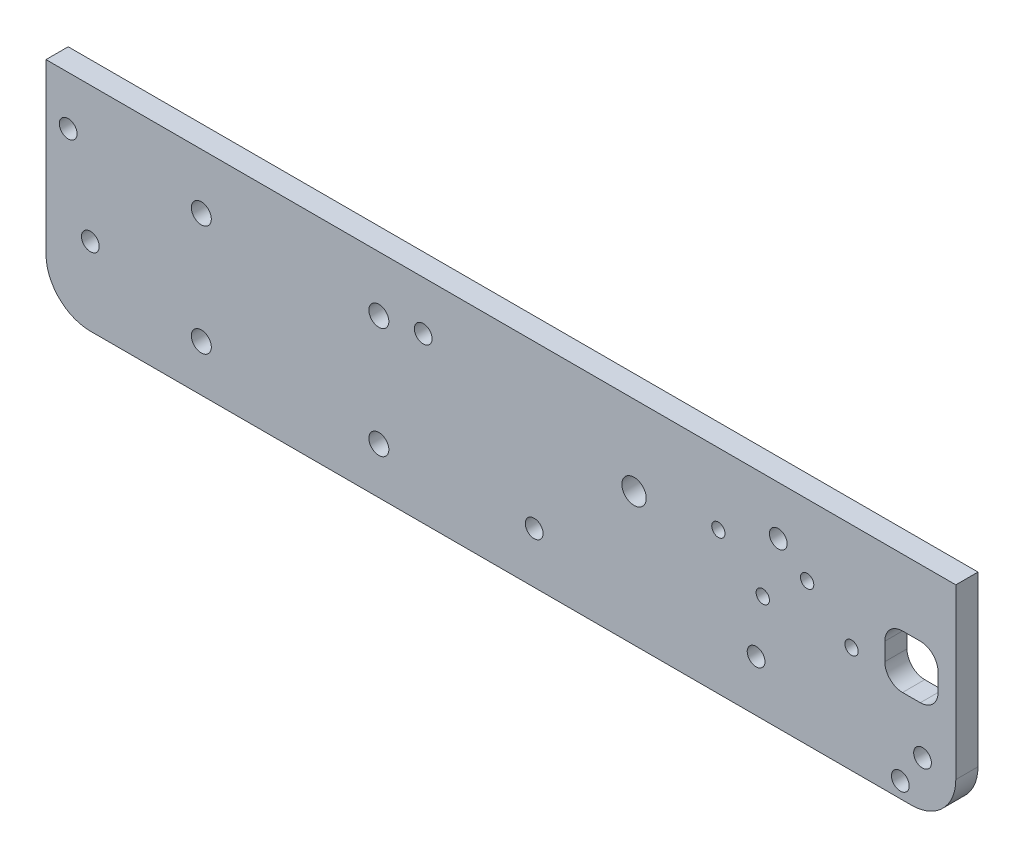
ISO-10303-21;
HEADER;
FILE_DESCRIPTION(('STEP AP214'),'2;1');
FILE_NAME('part.step','',(''),(''),'','','');
FILE_SCHEMA(('AUTOMOTIVE_DESIGN { 1 0 10303 214 1 1 1 1 }'));
ENDSEC;
DATA;
#1=APPLICATION_CONTEXT('core data for automotive mechanical design processes');
#2=APPLICATION_PROTOCOL_DEFINITION('international standard','automotive_design',2000,#1);
#3=PRODUCT_CONTEXT('',#1,'mechanical');
#4=PRODUCT('Part','Part','',(#3));
#5=PRODUCT_RELATED_PRODUCT_CATEGORY('part','',(#4));
#6=PRODUCT_DEFINITION_FORMATION('','',#4);
#7=PRODUCT_DEFINITION_CONTEXT('part definition',#1,'design');
#8=PRODUCT_DEFINITION('design','',#6,#7);
#9=PRODUCT_DEFINITION_SHAPE('','',#8);
#10=(LENGTH_UNIT() NAMED_UNIT(*) SI_UNIT(.MILLI.,.METRE.));
#11=(NAMED_UNIT(*) PLANE_ANGLE_UNIT() SI_UNIT($,.RADIAN.));
#12=(NAMED_UNIT(*) SI_UNIT($,.STERADIAN.) SOLID_ANGLE_UNIT());
#13=UNCERTAINTY_MEASURE_WITH_UNIT(LENGTH_MEASURE(1.E-05),#10,'distance_accuracy_value','');
#14=(GEOMETRIC_REPRESENTATION_CONTEXT(3) GLOBAL_UNCERTAINTY_ASSIGNED_CONTEXT((#13)) GLOBAL_UNIT_ASSIGNED_CONTEXT((#10,
#11,#12)) REPRESENTATION_CONTEXT('',''));
#15=CARTESIAN_POINT('',(0.,0.,0.));
#16=DIRECTION('',(0.,0.,1.));
#17=DIRECTION('',(1.,0.,0.));
#18=AXIS2_PLACEMENT_3D('',#15,#16,#17);
#19=CARTESIAN_POINT('',(-75.,-38.,5.));
#20=DIRECTION('',(0.,0.,-1.));
#21=DIRECTION('',(-1.,0.,0.));
#22=AXIS2_PLACEMENT_3D('',#19,#20,#21);
#23=PLANE('',#22);
#24=CARTESIAN_POINT('',(66.5,-16.,5.));
#25=DIRECTION('',(0.,0.,-1.));
#26=DIRECTION('',(-1.,0.,0.));
#27=AXIS2_PLACEMENT_3D('',#24,#25,#26);
#28=CIRCLE('',#27,1.5);
#29=CARTESIAN_POINT('',(65.,-16.,5.));
#30=VERTEX_POINT('',#29);
#31=EDGE_CURVE('E162',#30,#30,#28,.F.);
#32=ORIENTED_EDGE('',*,*,#31,.F.);
#33=EDGE_LOOP('',(#32));
#34=FACE_BOUND('',#33,.T.);
#35=CARTESIAN_POINT('',(76.5,-24.,5.));
#36=DIRECTION('',(0.,0.,-1.));
#37=DIRECTION('',(-1.,0.,0.));
#38=AXIS2_PLACEMENT_3D('',#35,#36,#37);
#39=CIRCLE('',#38,1.5);
#40=CARTESIAN_POINT('',(75.,-24.,5.));
#41=VERTEX_POINT('',#40);
#42=EDGE_CURVE('E165',#41,#41,#39,.F.);
#43=ORIENTED_EDGE('',*,*,#42,.F.);
#44=EDGE_LOOP('',(#43));
#45=FACE_BOUND('',#44,.T.);
#46=CARTESIAN_POINT('',(86.5,-16.,5.));
#47=DIRECTION('',(0.,0.,-1.));
#48=DIRECTION('',(-1.,0.,0.));
#49=AXIS2_PLACEMENT_3D('',#46,#47,#48);
#50=CIRCLE('',#49,1.5);
#51=CARTESIAN_POINT('',(85.,-16.,5.));
#52=VERTEX_POINT('',#51);
#53=EDGE_CURVE('E475',#52,#52,#50,.F.);
#54=ORIENTED_EDGE('',*,*,#53,.F.);
#55=EDGE_LOOP('',(#54));
#56=FACE_BOUND('',#55,.T.);
#57=CARTESIAN_POINT('',(96.5,-24.,5.));
#58=DIRECTION('',(0.,0.,-1.));
#59=DIRECTION('',(-1.,0.,0.));
#60=AXIS2_PLACEMENT_3D('',#57,#58,#59);
#61=CIRCLE('',#60,1.5);
#62=CARTESIAN_POINT('',(95.,-24.,5.));
#63=VERTEX_POINT('',#62);
#64=EDGE_CURVE('E471',#63,#63,#61,.F.);
#65=ORIENTED_EDGE('',*,*,#64,.F.);
#66=EDGE_LOOP('',(#65));
#67=FACE_BOUND('',#66,.T.);
#68=CARTESIAN_POINT('',(107.5,-44.5,5.));
#69=DIRECTION('',(0.,0.,-1.));
#70=DIRECTION('',(-1.,0.,0.));
#71=AXIS2_PLACEMENT_3D('',#68,#69,#70);
#72=CIRCLE('',#71,2.00000000000001);
#73=CARTESIAN_POINT('',(105.5,-44.5,5.));
#74=VERTEX_POINT('',#73);
#75=EDGE_CURVE('E246',#74,#74,#72,.F.);
#76=ORIENTED_EDGE('',*,*,#75,.F.);
#77=EDGE_LOOP('',(#76));
#78=FACE_BOUND('',#77,.T.);
#79=DIRECTION('',(0.,-1.,0.));
#80=VECTOR('',#79,1.);
#81=CARTESIAN_POINT('',(104.,-38.,5.));
#82=LINE('',#81,#80);
#83=CARTESIAN_POINT('',(104.,-19.,5.));
#84=VERTEX_POINT('',#83);
#85=CARTESIAN_POINT('',(104.,-23.,5.));
#86=VERTEX_POINT('',#85);
#87=EDGE_CURVE('E142',#84,#86,#82,.T.);
#88=ORIENTED_EDGE('',*,*,#87,.F.);
#89=CARTESIAN_POINT('',(108.,-19.,5.));
#90=DIRECTION('',(0.,0.,-1.));
#91=DIRECTION('',(-1.,0.,0.));
#92=AXIS2_PLACEMENT_3D('',#89,#90,#91);
#93=CIRCLE('',#92,4.);
#94=CARTESIAN_POINT('',(108.,-15.,5.));
#95=VERTEX_POINT('',#94);
#96=EDGE_CURVE('E228',#95,#84,#93,.F.);
#97=ORIENTED_EDGE('',*,*,#96,.F.);
#98=DIRECTION('',(1.,0.,0.));
#99=VECTOR('',#98,1.);
#100=CARTESIAN_POINT('',(-75.,-15.,5.));
#101=LINE('',#100,#99);
#102=CARTESIAN_POINT('',(112.,-15.,5.));
#103=VERTEX_POINT('',#102);
#104=EDGE_CURVE('E230',#95,#103,#101,.T.);
#105=ORIENTED_EDGE('',*,*,#104,.T.);
#106=CARTESIAN_POINT('',(112.,-19.,5.));
#107=DIRECTION('',(0.,0.,-1.));
#108=DIRECTION('',(-1.,0.,0.));
#109=AXIS2_PLACEMENT_3D('',#106,#107,#108);
#110=CIRCLE('',#109,4.);
#111=CARTESIAN_POINT('',(116.,-19.,5.));
#112=VERTEX_POINT('',#111);
#113=EDGE_CURVE('E233',#103,#112,#110,.T.);
#114=ORIENTED_EDGE('',*,*,#113,.T.);
#115=DIRECTION('',(0.,-1.,0.));
#116=VECTOR('',#115,1.);
#117=CARTESIAN_POINT('',(116.,-38.,5.));
#118=LINE('',#117,#116);
#119=CARTESIAN_POINT('',(116.,-23.,5.));
#120=VERTEX_POINT('',#119);
#121=EDGE_CURVE('E236',#112,#120,#118,.T.);
#122=ORIENTED_EDGE('',*,*,#121,.T.);
#123=CARTESIAN_POINT('',(112.,-23.,5.));
#124=DIRECTION('',(0.,0.,-1.));
#125=DIRECTION('',(-1.,0.,0.));
#126=AXIS2_PLACEMENT_3D('',#123,#124,#125);
#127=CIRCLE('',#126,4.);
#128=CARTESIAN_POINT('',(112.,-27.,5.));
#129=VERTEX_POINT('',#128);
#130=EDGE_CURVE('E239',#129,#120,#127,.F.);
#131=ORIENTED_EDGE('',*,*,#130,.F.);
#132=DIRECTION('',(1.,0.,0.));
#133=VECTOR('',#132,1.);
#134=CARTESIAN_POINT('',(-75.,-27.,5.));
#135=LINE('',#134,#133);
#136=CARTESIAN_POINT('',(108.,-27.,5.));
#137=VERTEX_POINT('',#136);
#138=EDGE_CURVE('E241',#137,#129,#135,.T.);
#139=ORIENTED_EDGE('',*,*,#138,.F.);
#140=CARTESIAN_POINT('',(108.,-23.,5.));
#141=DIRECTION('',(0.,0.,-1.));
#142=DIRECTION('',(-1.,0.,0.));
#143=AXIS2_PLACEMENT_3D('',#140,#141,#142);
#144=CIRCLE('',#143,4.);
#145=EDGE_CURVE('E243',#86,#137,#144,.F.);
#146=ORIENTED_EDGE('',*,*,#145,.F.);
#147=EDGE_LOOP('',(#88,#97,#105,#114,#122,#131,#139,#146));
#148=FACE_BOUND('',#147,.T.);
#149=CARTESIAN_POINT('',(47.5,-18.,5.));
#150=DIRECTION('',(0.,0.,-1.));
#151=DIRECTION('',(-1.,0.,0.));
#152=AXIS2_PLACEMENT_3D('',#149,#150,#151);
#153=CIRCLE('',#152,2.75);
#154=CARTESIAN_POINT('',(44.75,-18.,5.));
#155=VERTEX_POINT('',#154);
#156=EDGE_CURVE('E225',#155,#155,#153,.F.);
#157=ORIENTED_EDGE('',*,*,#156,.F.);
#158=EDGE_LOOP('',(#157));
#159=FACE_BOUND('',#158,.T.);
#160=CARTESIAN_POINT('',(-9.99999999999999,-37.5,5.));
#161=DIRECTION('',(0.,0.,-1.));
#162=DIRECTION('',(-1.,0.,0.));
#163=AXIS2_PLACEMENT_3D('',#160,#161,#162);
#164=CIRCLE('',#163,2.25);
#165=CARTESIAN_POINT('',(-12.25,-37.5,5.));
#166=VERTEX_POINT('',#165);
#167=EDGE_CURVE('E222',#166,#166,#164,.F.);
#168=ORIENTED_EDGE('',*,*,#167,.F.);
#169=EDGE_LOOP('',(#168));
#170=FACE_BOUND('',#169,.T.);
#171=CARTESIAN_POINT('',(-9.99999999999999,-12.5,5.));
#172=DIRECTION('',(0.,0.,-1.));
#173=DIRECTION('',(-1.,0.,0.));
#174=AXIS2_PLACEMENT_3D('',#171,#172,#173);
#175=CIRCLE('',#174,2.25);
#176=CARTESIAN_POINT('',(-12.25,-12.5,5.));
#177=VERTEX_POINT('',#176);
#178=EDGE_CURVE('E219',#177,#177,#175,.F.);
#179=ORIENTED_EDGE('',*,*,#178,.F.);
#180=EDGE_LOOP('',(#179));
#181=FACE_BOUND('',#180,.T.);
#182=CARTESIAN_POINT('',(-50.,-12.5,5.));
#183=DIRECTION('',(0.,0.,-1.));
#184=DIRECTION('',(-1.,0.,0.));
#185=AXIS2_PLACEMENT_3D('',#182,#183,#184);
#186=CIRCLE('',#185,2.25);
#187=CARTESIAN_POINT('',(-52.25,-12.5,5.));
#188=VERTEX_POINT('',#187);
#189=EDGE_CURVE('E216',#188,#188,#186,.F.);
#190=ORIENTED_EDGE('',*,*,#189,.F.);
#191=EDGE_LOOP('',(#190));
#192=FACE_BOUND('',#191,.T.);
#193=CARTESIAN_POINT('',(-50.,-37.5,5.));
#194=DIRECTION('',(0.,0.,-1.));
#195=DIRECTION('',(-1.,0.,0.));
#196=AXIS2_PLACEMENT_3D('',#193,#194,#195);
#197=CIRCLE('',#196,2.25);
#198=CARTESIAN_POINT('',(-52.25,-37.5,5.));
#199=VERTEX_POINT('',#198);
#200=EDGE_CURVE('E213',#199,#199,#197,.F.);
#201=ORIENTED_EDGE('',*,*,#200,.F.);
#202=EDGE_LOOP('',(#201));
#203=FACE_BOUND('',#202,.T.);
#204=CARTESIAN_POINT('',(112.5,-37.5,5.));
#205=DIRECTION('',(0.,0.,-1.));
#206=DIRECTION('',(-1.,0.,0.));
#207=AXIS2_PLACEMENT_3D('',#204,#205,#206);
#208=CIRCLE('',#207,2.);
#209=CARTESIAN_POINT('',(110.5,-37.5,5.));
#210=VERTEX_POINT('',#209);
#211=EDGE_CURVE('E210',#210,#210,#208,.F.);
#212=ORIENTED_EDGE('',*,*,#211,.F.);
#213=EDGE_LOOP('',(#212));
#214=FACE_BOUND('',#213,.T.);
#215=DIRECTION('',(0.,-1.,0.));
#216=VECTOR('',#215,1.);
#217=CARTESIAN_POINT('',(-85.,0.,5.));
#218=LINE('',#217,#216);
#219=CARTESIAN_POINT('',(-85.,0.,5.));
#220=VERTEX_POINT('',#219);
#221=CARTESIAN_POINT('',(-85.,-38.,5.));
#222=VERTEX_POINT('',#221);
#223=EDGE_CURVE('E286',#220,#222,#218,.T.);
#224=ORIENTED_EDGE('',*,*,#223,.T.);
#225=CARTESIAN_POINT('',(-75.,-38.,5.));
#226=DIRECTION('',(0.,0.,1.));
#227=DIRECTION('',(-1.,0.,0.));
#228=AXIS2_PLACEMENT_3D('',#225,#226,#227);
#229=CIRCLE('',#228,9.99999999999999);
#230=CARTESIAN_POINT('',(-75.,-48.,5.));
#231=VERTEX_POINT('',#230);
#232=EDGE_CURVE('E289',#222,#231,#229,.T.);
#233=ORIENTED_EDGE('',*,*,#232,.T.);
#234=DIRECTION('',(1.,0.,0.));
#235=VECTOR('',#234,1.);
#236=CARTESIAN_POINT('',(-75.,-48.,5.));
#237=LINE('',#236,#235);
#238=CARTESIAN_POINT('',(110.,-48.,5.));
#239=VERTEX_POINT('',#238);
#240=EDGE_CURVE('E292',#231,#239,#237,.T.);
#241=ORIENTED_EDGE('',*,*,#240,.T.);
#242=CARTESIAN_POINT('',(110.,-38.,5.));
#243=DIRECTION('',(0.,0.,1.));
#244=DIRECTION('',(-1.,0.,0.));
#245=AXIS2_PLACEMENT_3D('',#242,#243,#244);
#246=CIRCLE('',#245,10.);
#247=CARTESIAN_POINT('',(120.,-38.,5.));
#248=VERTEX_POINT('',#247);
#249=EDGE_CURVE('E294',#239,#248,#246,.T.);
#250=ORIENTED_EDGE('',*,*,#249,.T.);
#251=DIRECTION('',(0.,1.,0.));
#252=VECTOR('',#251,1.);
#253=CARTESIAN_POINT('',(120.,0.,5.));
#254=LINE('',#253,#252);
#255=CARTESIAN_POINT('',(120.,0.,5.));
#256=VERTEX_POINT('',#255);
#257=EDGE_CURVE('E296',#248,#256,#254,.T.);
#258=ORIENTED_EDGE('',*,*,#257,.T.);
#259=DIRECTION('',(-1.,0.,0.));
#260=VECTOR('',#259,1.);
#261=CARTESIAN_POINT('',(-85.,0.,5.));
#262=LINE('',#261,#260);
#263=EDGE_CURVE('E298',#256,#220,#262,.T.);
#264=ORIENTED_EDGE('',*,*,#263,.T.);
#265=EDGE_LOOP('',(#224,#233,#241,#250,#258,#264));
#266=FACE_BOUND('',#265,.T.);
#267=CARTESIAN_POINT('',(75.,-36.5,5.));
#268=DIRECTION('',(0.,0.,1.));
#269=DIRECTION('',(1.,0.,0.));
#270=AXIS2_PLACEMENT_3D('',#267,#268,#269);
#271=CIRCLE('',#270,1.99999999999987);
#272=CARTESIAN_POINT('',(76.9999999999999,-36.5,5.));
#273=VERTEX_POINT('',#272);
#274=EDGE_CURVE('E280',#273,#273,#271,.T.);
#275=ORIENTED_EDGE('',*,*,#274,.F.);
#276=EDGE_LOOP('',(#275));
#277=FACE_BOUND('',#276,.T.);
#278=CARTESIAN_POINT('',(-80.,-11.,5.));
#279=DIRECTION('',(0.,0.,1.));
#280=DIRECTION('',(1.,0.,0.));
#281=AXIS2_PLACEMENT_3D('',#278,#279,#280);
#282=CIRCLE('',#281,2.);
#283=CARTESIAN_POINT('',(-78.,-11.,5.));
#284=VERTEX_POINT('',#283);
#285=EDGE_CURVE('E274',#284,#284,#282,.T.);
#286=ORIENTED_EDGE('',*,*,#285,.F.);
#287=EDGE_LOOP('',(#286));
#288=FACE_BOUND('',#287,.T.);
#289=CARTESIAN_POINT('',(0.,-11.,5.));
#290=DIRECTION('',(0.,0.,1.));
#291=DIRECTION('',(1.,0.,0.));
#292=AXIS2_PLACEMENT_3D('',#289,#290,#291);
#293=CIRCLE('',#292,2.);
#294=CARTESIAN_POINT('',(2.,-11.,5.));
#295=VERTEX_POINT('',#294);
#296=EDGE_CURVE('E268',#295,#295,#293,.T.);
#297=ORIENTED_EDGE('',*,*,#296,.F.);
#298=EDGE_LOOP('',(#297));
#299=FACE_BOUND('',#298,.T.);
#300=CARTESIAN_POINT('',(80.,-11.,5.));
#301=DIRECTION('',(0.,0.,1.));
#302=DIRECTION('',(1.,0.,0.));
#303=AXIS2_PLACEMENT_3D('',#300,#301,#302);
#304=CIRCLE('',#303,2.);
#305=CARTESIAN_POINT('',(82.,-11.,5.));
#306=VERTEX_POINT('',#305);
#307=EDGE_CURVE('E262',#306,#306,#304,.T.);
#308=ORIENTED_EDGE('',*,*,#307,.F.);
#309=EDGE_LOOP('',(#308));
#310=FACE_BOUND('',#309,.T.);
#311=CARTESIAN_POINT('',(25.,-36.5,5.));
#312=DIRECTION('',(0.,0.,1.));
#313=DIRECTION('',(1.,0.,0.));
#314=AXIS2_PLACEMENT_3D('',#311,#312,#313);
#315=CIRCLE('',#314,1.99999999999987);
#316=CARTESIAN_POINT('',(26.9999999999999,-36.5,5.));
#317=VERTEX_POINT('',#316);
#318=EDGE_CURVE('E256',#317,#317,#315,.T.);
#319=ORIENTED_EDGE('',*,*,#318,.F.);
#320=EDGE_LOOP('',(#319));
#321=FACE_BOUND('',#320,.T.);
#322=CARTESIAN_POINT('',(-75.,-30.5,5.));
#323=DIRECTION('',(0.,0.,1.));
#324=DIRECTION('',(-1.,0.,0.));
#325=AXIS2_PLACEMENT_3D('',#322,#323,#324);
#326=CIRCLE('',#325,1.99999999999997);
#327=CARTESIAN_POINT('',(-76.9999999999999,-30.5,5.));
#328=VERTEX_POINT('',#327);
#329=EDGE_CURVE('E250',#328,#328,#326,.T.);
#330=ORIENTED_EDGE('',*,*,#329,.F.);
#331=EDGE_LOOP('',(#330));
#332=FACE_BOUND('',#331,.T.);
#333=ADVANCED_FACE('F38',(#34,#45,#56,#67,#78,#148,#159,#170,#181,#192,#203,#214,#266,#277,#288,
#299,#310,#321,#332),#23,.F.);
#334=CARTESIAN_POINT('',(-75.,-38.,0.));
#335=DIRECTION('',(0.,0.,-1.));
#336=DIRECTION('',(-1.,0.,0.));
#337=AXIS2_PLACEMENT_3D('',#334,#335,#336);
#338=PLANE('',#337);
#339=CARTESIAN_POINT('',(66.5,-16.,0.));
#340=DIRECTION('',(0.,0.,1.));
#341=DIRECTION('',(1.,0.,0.));
#342=AXIS2_PLACEMENT_3D('',#339,#340,#341);
#343=CIRCLE('',#342,1.5);
#344=CARTESIAN_POINT('',(68.,-16.,0.));
#345=VERTEX_POINT('',#344);
#346=EDGE_CURVE('E470',#345,#345,#343,.T.);
#347=ORIENTED_EDGE('',*,*,#346,.T.);
#348=EDGE_LOOP('',(#347));
#349=FACE_BOUND('',#348,.T.);
#350=CARTESIAN_POINT('',(76.5,-24.,0.));
#351=DIRECTION('',(0.,0.,1.));
#352=DIRECTION('',(1.,0.,0.));
#353=AXIS2_PLACEMENT_3D('',#350,#351,#352);
#354=CIRCLE('',#353,1.5);
#355=CARTESIAN_POINT('',(78.,-24.,0.));
#356=VERTEX_POINT('',#355);
#357=EDGE_CURVE('E472',#356,#356,#354,.T.);
#358=ORIENTED_EDGE('',*,*,#357,.T.);
#359=EDGE_LOOP('',(#358));
#360=FACE_BOUND('',#359,.T.);
#361=CARTESIAN_POINT('',(86.5,-16.,0.));
#362=DIRECTION('',(0.,0.,1.));
#363=DIRECTION('',(1.,0.,0.));
#364=AXIS2_PLACEMENT_3D('',#361,#362,#363);
#365=CIRCLE('',#364,1.5);
#366=CARTESIAN_POINT('',(88.,-16.,0.));
#367=VERTEX_POINT('',#366);
#368=EDGE_CURVE('E478',#367,#367,#365,.T.);
#369=ORIENTED_EDGE('',*,*,#368,.T.);
#370=EDGE_LOOP('',(#369));
#371=FACE_BOUND('',#370,.T.);
#372=CARTESIAN_POINT('',(96.5,-24.,0.));
#373=DIRECTION('',(0.,0.,1.));
#374=DIRECTION('',(1.,0.,0.));
#375=AXIS2_PLACEMENT_3D('',#372,#373,#374);
#376=CIRCLE('',#375,1.5);
#377=CARTESIAN_POINT('',(98.,-24.,0.));
#378=VERTEX_POINT('',#377);
#379=EDGE_CURVE('E483',#378,#378,#376,.T.);
#380=ORIENTED_EDGE('',*,*,#379,.T.);
#381=EDGE_LOOP('',(#380));
#382=FACE_BOUND('',#381,.T.);
#383=CARTESIAN_POINT('',(107.5,-44.5,0.));
#384=DIRECTION('',(0.,0.,1.));
#385=DIRECTION('',(1.,0.,0.));
#386=AXIS2_PLACEMENT_3D('',#383,#384,#385);
#387=CIRCLE('',#386,2.00000000000001);
#388=CARTESIAN_POINT('',(109.5,-44.5,0.));
#389=VERTEX_POINT('',#388);
#390=EDGE_CURVE('E199',#389,#389,#387,.T.);
#391=ORIENTED_EDGE('',*,*,#390,.T.);
#392=EDGE_LOOP('',(#391));
#393=FACE_BOUND('',#392,.T.);
#394=CARTESIAN_POINT('',(108.,-19.,0.));
#395=DIRECTION('',(0.,0.,1.));
#396=DIRECTION('',(1.,0.,0.));
#397=AXIS2_PLACEMENT_3D('',#394,#395,#396);
#398=CIRCLE('',#397,4.);
#399=CARTESIAN_POINT('',(108.,-15.,0.));
#400=VERTEX_POINT('',#399);
#401=CARTESIAN_POINT('',(104.,-19.,0.));
#402=VERTEX_POINT('',#401);
#403=EDGE_CURVE('E161',#400,#402,#398,.T.);
#404=ORIENTED_EDGE('',*,*,#403,.T.);
#405=DIRECTION('',(0.,-1.,0.));
#406=VECTOR('',#405,1.);
#407=CARTESIAN_POINT('',(104.,0.,0.));
#408=LINE('',#407,#406);
#409=CARTESIAN_POINT('',(104.,-23.,0.));
#410=VERTEX_POINT('',#409);
#411=EDGE_CURVE('E61',#402,#410,#408,.T.);
#412=ORIENTED_EDGE('',*,*,#411,.T.);
#413=CARTESIAN_POINT('',(108.,-23.,0.));
#414=DIRECTION('',(0.,0.,1.));
#415=DIRECTION('',(1.,0.,0.));
#416=AXIS2_PLACEMENT_3D('',#413,#414,#415);
#417=CIRCLE('',#416,4.);
#418=CARTESIAN_POINT('',(108.,-27.,0.));
#419=VERTEX_POINT('',#418);
#420=EDGE_CURVE('E149',#410,#419,#417,.T.);
#421=ORIENTED_EDGE('',*,*,#420,.T.);
#422=DIRECTION('',(1.,0.,0.));
#423=VECTOR('',#422,1.);
#424=CARTESIAN_POINT('',(0.,-27.,0.));
#425=LINE('',#424,#423);
#426=CARTESIAN_POINT('',(112.,-27.,0.));
#427=VERTEX_POINT('',#426);
#428=EDGE_CURVE('E155',#419,#427,#425,.T.);
#429=ORIENTED_EDGE('',*,*,#428,.T.);
#430=CARTESIAN_POINT('',(112.,-23.,0.));
#431=DIRECTION('',(0.,0.,1.));
#432=DIRECTION('',(1.,0.,0.));
#433=AXIS2_PLACEMENT_3D('',#430,#431,#432);
#434=CIRCLE('',#433,4.);
#435=CARTESIAN_POINT('',(116.,-23.,0.));
#436=VERTEX_POINT('',#435);
#437=EDGE_CURVE('E171',#427,#436,#434,.T.);
#438=ORIENTED_EDGE('',*,*,#437,.T.);
#439=DIRECTION('',(0.,-1.,0.));
#440=VECTOR('',#439,1.);
#441=CARTESIAN_POINT('',(116.,0.,0.));
#442=LINE('',#441,#440);
#443=CARTESIAN_POINT('',(116.,-19.,0.));
#444=VERTEX_POINT('',#443);
#445=EDGE_CURVE('E174',#444,#436,#442,.T.);
#446=ORIENTED_EDGE('',*,*,#445,.F.);
#447=CARTESIAN_POINT('',(112.,-19.,0.));
#448=DIRECTION('',(0.,0.,1.));
#449=DIRECTION('',(1.,0.,0.));
#450=AXIS2_PLACEMENT_3D('',#447,#448,#449);
#451=CIRCLE('',#450,4.);
#452=CARTESIAN_POINT('',(112.,-15.,0.));
#453=VERTEX_POINT('',#452);
#454=EDGE_CURVE('E177',#453,#444,#451,.F.);
#455=ORIENTED_EDGE('',*,*,#454,.F.);
#456=DIRECTION('',(1.,0.,0.));
#457=VECTOR('',#456,1.);
#458=CARTESIAN_POINT('',(0.,-15.,0.));
#459=LINE('',#458,#457);
#460=EDGE_CURVE('E180',#400,#453,#459,.T.);
#461=ORIENTED_EDGE('',*,*,#460,.F.);
#462=EDGE_LOOP('',(#404,#412,#421,#429,#438,#446,#455,#461));
#463=FACE_BOUND('',#462,.T.);
#464=CARTESIAN_POINT('',(47.5,-18.,0.));
#465=DIRECTION('',(0.,0.,1.));
#466=DIRECTION('',(1.,0.,0.));
#467=AXIS2_PLACEMENT_3D('',#464,#465,#466);
#468=CIRCLE('',#467,2.75);
#469=CARTESIAN_POINT('',(50.25,-18.,0.));
#470=VERTEX_POINT('',#469);
#471=EDGE_CURVE('E145',#470,#470,#468,.T.);
#472=ORIENTED_EDGE('',*,*,#471,.T.);
#473=EDGE_LOOP('',(#472));
#474=FACE_BOUND('',#473,.T.);
#475=CARTESIAN_POINT('',(-9.99999999999999,-37.5,0.));
#476=DIRECTION('',(0.,0.,1.));
#477=DIRECTION('',(1.,0.,0.));
#478=AXIS2_PLACEMENT_3D('',#475,#476,#477);
#479=CIRCLE('',#478,2.25);
#480=CARTESIAN_POINT('',(-7.74999999999999,-37.5,0.));
#481=VERTEX_POINT('',#480);
#482=EDGE_CURVE('E209',#481,#481,#479,.T.);
#483=ORIENTED_EDGE('',*,*,#482,.T.);
#484=EDGE_LOOP('',(#483));
#485=FACE_BOUND('',#484,.T.);
#486=CARTESIAN_POINT('',(-9.99999999999999,-12.5,0.));
#487=DIRECTION('',(0.,0.,1.));
#488=DIRECTION('',(1.,0.,0.));
#489=AXIS2_PLACEMENT_3D('',#486,#487,#488);
#490=CIRCLE('',#489,2.25);
#491=CARTESIAN_POINT('',(-7.74999999999999,-12.5,0.));
#492=VERTEX_POINT('',#491);
#493=EDGE_CURVE('E206',#492,#492,#490,.T.);
#494=ORIENTED_EDGE('',*,*,#493,.T.);
#495=EDGE_LOOP('',(#494));
#496=FACE_BOUND('',#495,.T.);
#497=CARTESIAN_POINT('',(-50.,-12.5,0.));
#498=DIRECTION('',(0.,0.,1.));
#499=DIRECTION('',(1.,0.,0.));
#500=AXIS2_PLACEMENT_3D('',#497,#498,#499);
#501=CIRCLE('',#500,2.25);
#502=CARTESIAN_POINT('',(-47.75,-12.5,0.));
#503=VERTEX_POINT('',#502);
#504=EDGE_CURVE('E203',#503,#503,#501,.T.);
#505=ORIENTED_EDGE('',*,*,#504,.T.);
#506=EDGE_LOOP('',(#505));
#507=FACE_BOUND('',#506,.T.);
#508=CARTESIAN_POINT('',(-50.,-37.5,0.));
#509=DIRECTION('',(0.,0.,1.));
#510=DIRECTION('',(1.,0.,0.));
#511=AXIS2_PLACEMENT_3D('',#508,#509,#510);
#512=CIRCLE('',#511,2.25);
#513=CARTESIAN_POINT('',(-47.75,-37.5,0.));
#514=VERTEX_POINT('',#513);
#515=EDGE_CURVE('E200',#514,#514,#512,.T.);
#516=ORIENTED_EDGE('',*,*,#515,.T.);
#517=EDGE_LOOP('',(#516));
#518=FACE_BOUND('',#517,.T.);
#519=CARTESIAN_POINT('',(112.5,-37.5,0.));
#520=DIRECTION('',(0.,0.,1.));
#521=DIRECTION('',(1.,0.,0.));
#522=AXIS2_PLACEMENT_3D('',#519,#520,#521);
#523=CIRCLE('',#522,2.);
#524=CARTESIAN_POINT('',(114.5,-37.5,0.));
#525=VERTEX_POINT('',#524);
#526=EDGE_CURVE('E196',#525,#525,#523,.T.);
#527=ORIENTED_EDGE('',*,*,#526,.T.);
#528=EDGE_LOOP('',(#527));
#529=FACE_BOUND('',#528,.T.);
#530=CARTESIAN_POINT('',(25.,-36.5,0.));
#531=DIRECTION('',(0.,0.,1.));
#532=DIRECTION('',(1.,0.,0.));
#533=AXIS2_PLACEMENT_3D('',#530,#531,#532);
#534=CIRCLE('',#533,1.99999999999987);
#535=CARTESIAN_POINT('',(26.9999999999999,-36.5,0.));
#536=VERTEX_POINT('',#535);
#537=EDGE_CURVE('E253',#536,#536,#534,.T.);
#538=ORIENTED_EDGE('',*,*,#537,.T.);
#539=EDGE_LOOP('',(#538));
#540=FACE_BOUND('',#539,.T.);
#541=CARTESIAN_POINT('',(0.,-11.,0.));
#542=DIRECTION('',(0.,0.,1.));
#543=DIRECTION('',(1.,0.,0.));
#544=AXIS2_PLACEMENT_3D('',#541,#542,#543);
#545=CIRCLE('',#544,2.);
#546=CARTESIAN_POINT('',(2.,-11.,0.));
#547=VERTEX_POINT('',#546);
#548=EDGE_CURVE('E265',#547,#547,#545,.T.);
#549=ORIENTED_EDGE('',*,*,#548,.T.);
#550=EDGE_LOOP('',(#549));
#551=FACE_BOUND('',#550,.T.);
#552=CARTESIAN_POINT('',(75.,-36.5,0.));
#553=DIRECTION('',(0.,0.,1.));
#554=DIRECTION('',(1.,0.,0.));
#555=AXIS2_PLACEMENT_3D('',#552,#553,#554);
#556=CIRCLE('',#555,1.99999999999987);
#557=CARTESIAN_POINT('',(76.9999999999999,-36.5,0.));
#558=VERTEX_POINT('',#557);
#559=EDGE_CURVE('E277',#558,#558,#556,.T.);
#560=ORIENTED_EDGE('',*,*,#559,.T.);
#561=EDGE_LOOP('',(#560));
#562=FACE_BOUND('',#561,.T.);
#563=DIRECTION('',(0.,-1.,0.));
#564=VECTOR('',#563,1.);
#565=CARTESIAN_POINT('',(-85.,0.,0.));
#566=LINE('',#565,#564);
#567=CARTESIAN_POINT('',(-85.,0.,0.));
#568=VERTEX_POINT('',#567);
#569=CARTESIAN_POINT('',(-85.,-38.,0.));
#570=VERTEX_POINT('',#569);
#571=EDGE_CURVE('E283',#568,#570,#566,.T.);
#572=ORIENTED_EDGE('',*,*,#571,.F.);
#573=DIRECTION('',(-1.,0.,0.));
#574=VECTOR('',#573,1.);
#575=CARTESIAN_POINT('',(-85.,0.,0.));
#576=LINE('',#575,#574);
#577=CARTESIAN_POINT('',(120.,0.,0.));
#578=VERTEX_POINT('',#577);
#579=EDGE_CURVE('E290',#578,#568,#576,.T.);
#580=ORIENTED_EDGE('',*,*,#579,.F.);
#581=DIRECTION('',(0.,1.,0.));
#582=VECTOR('',#581,1.);
#583=CARTESIAN_POINT('',(120.,0.,0.));
#584=LINE('',#583,#582);
#585=CARTESIAN_POINT('',(120.,-38.,0.));
#586=VERTEX_POINT('',#585);
#587=EDGE_CURVE('E309',#586,#578,#584,.T.);
#588=ORIENTED_EDGE('',*,*,#587,.F.);
#589=CARTESIAN_POINT('',(110.,-38.,0.));
#590=DIRECTION('',(0.,0.,1.));
#591=DIRECTION('',(-1.,0.,0.));
#592=AXIS2_PLACEMENT_3D('',#589,#590,#591);
#593=CIRCLE('',#592,10.);
#594=CARTESIAN_POINT('',(110.,-48.,0.));
#595=VERTEX_POINT('',#594);
#596=EDGE_CURVE('E307',#595,#586,#593,.T.);
#597=ORIENTED_EDGE('',*,*,#596,.F.);
#598=DIRECTION('',(1.,0.,0.));
#599=VECTOR('',#598,1.);
#600=CARTESIAN_POINT('',(-75.,-48.,0.));
#601=LINE('',#600,#599);
#602=CARTESIAN_POINT('',(-75.,-48.,0.));
#603=VERTEX_POINT('',#602);
#604=EDGE_CURVE('E305',#603,#595,#601,.T.);
#605=ORIENTED_EDGE('',*,*,#604,.F.);
#606=CARTESIAN_POINT('',(-75.,-38.,0.));
#607=DIRECTION('',(0.,0.,1.));
#608=DIRECTION('',(-1.,0.,0.));
#609=AXIS2_PLACEMENT_3D('',#606,#607,#608);
#610=CIRCLE('',#609,9.99999999999999);
#611=EDGE_CURVE('E303',#570,#603,#610,.T.);
#612=ORIENTED_EDGE('',*,*,#611,.F.);
#613=EDGE_LOOP('',(#572,#580,#588,#597,#605,#612));
#614=FACE_BOUND('',#613,.T.);
#615=CARTESIAN_POINT('',(-80.,-11.,0.));
#616=DIRECTION('',(0.,0.,1.));
#617=DIRECTION('',(1.,0.,0.));
#618=AXIS2_PLACEMENT_3D('',#615,#616,#617);
#619=CIRCLE('',#618,2.);
#620=CARTESIAN_POINT('',(-78.,-11.,0.));
#621=VERTEX_POINT('',#620);
#622=EDGE_CURVE('E271',#621,#621,#619,.T.);
#623=ORIENTED_EDGE('',*,*,#622,.T.);
#624=EDGE_LOOP('',(#623));
#625=FACE_BOUND('',#624,.T.);
#626=CARTESIAN_POINT('',(80.,-11.,0.));
#627=DIRECTION('',(0.,0.,1.));
#628=DIRECTION('',(1.,0.,0.));
#629=AXIS2_PLACEMENT_3D('',#626,#627,#628);
#630=CIRCLE('',#629,2.);
#631=CARTESIAN_POINT('',(82.,-11.,0.));
#632=VERTEX_POINT('',#631);
#633=EDGE_CURVE('E259',#632,#632,#630,.T.);
#634=ORIENTED_EDGE('',*,*,#633,.T.);
#635=EDGE_LOOP('',(#634));
#636=FACE_BOUND('',#635,.T.);
#637=CARTESIAN_POINT('',(-75.,-30.5,0.));
#638=DIRECTION('',(0.,0.,1.));
#639=DIRECTION('',(-1.,0.,0.));
#640=AXIS2_PLACEMENT_3D('',#637,#638,#639);
#641=CIRCLE('',#640,1.99999999999997);
#642=CARTESIAN_POINT('',(-76.9999999999999,-30.5,0.));
#643=VERTEX_POINT('',#642);
#644=EDGE_CURVE('E249',#643,#643,#641,.T.);
#645=ORIENTED_EDGE('',*,*,#644,.T.);
#646=EDGE_LOOP('',(#645));
#647=FACE_BOUND('',#646,.T.);
#648=ADVANCED_FACE('F158',(#349,#360,#371,#382,#393,#463,#474,#485,#496,#507,#518,#529,#540,
#551,#562,#614,#625,#636,#647),#338,.T.);
#649=CARTESIAN_POINT('',(-85.,0.,5.));
#650=DIRECTION('',(1.,0.,0.));
#651=DIRECTION('',(0.,1.,0.));
#652=AXIS2_PLACEMENT_3D('',#649,#650,#651);
#653=PLANE('',#652);
#654=ORIENTED_EDGE('',*,*,#571,.T.);
#655=DIRECTION('',(0.,0.,-1.));
#656=VECTOR('',#655,1.);
#657=CARTESIAN_POINT('',(-85.,-38.,5.));
#658=LINE('',#657,#656);
#659=EDGE_CURVE('E11',#222,#570,#658,.T.);
#660=ORIENTED_EDGE('',*,*,#659,.F.);
#661=ORIENTED_EDGE('',*,*,#223,.F.);
#662=DIRECTION('',(0.,0.,-1.));
#663=VECTOR('',#662,1.);
#664=CARTESIAN_POINT('',(-85.,0.,5.));
#665=LINE('',#664,#663);
#666=EDGE_CURVE('E300',#220,#568,#665,.T.);
#667=ORIENTED_EDGE('',*,*,#666,.T.);
#668=EDGE_LOOP('',(#654,#660,#661,#667));
#669=FACE_BOUND('',#668,.T.);
#670=ADVANCED_FACE('F40',(#669),#653,.F.);
#671=CARTESIAN_POINT('',(-75.,-38.,5.));
#672=DIRECTION('',(0.,0.,-1.));
#673=DIRECTION('',(-1.,0.,0.));
#674=AXIS2_PLACEMENT_3D('',#671,#672,#673);
#675=CYLINDRICAL_SURFACE('',#674,9.99999999999999);
#676=ORIENTED_EDGE('',*,*,#611,.T.);
#677=DIRECTION('',(0.,0.,-1.));
#678=VECTOR('',#677,1.);
#679=CARTESIAN_POINT('',(-75.,-48.,5.));
#680=LINE('',#679,#678);
#681=EDGE_CURVE('E46',#231,#603,#680,.T.);
#682=ORIENTED_EDGE('',*,*,#681,.F.);
#683=ORIENTED_EDGE('',*,*,#232,.F.);
#684=ORIENTED_EDGE('',*,*,#659,.T.);
#685=EDGE_LOOP('',(#676,#682,#683,#684));
#686=FACE_BOUND('',#685,.T.);
#687=ADVANCED_FACE('F350',(#686),#675,.T.);
#688=CARTESIAN_POINT('',(-75.,-48.,5.));
#689=DIRECTION('',(0.,1.,0.));
#690=DIRECTION('',(-1.,0.,0.));
#691=AXIS2_PLACEMENT_3D('',#688,#689,#690);
#692=PLANE('',#691);
#693=ORIENTED_EDGE('',*,*,#604,.T.);
#694=DIRECTION('',(0.,0.,-1.));
#695=VECTOR('',#694,1.);
#696=CARTESIAN_POINT('',(110.,-48.,5.));
#697=LINE('',#696,#695);
#698=EDGE_CURVE('E320',#239,#595,#697,.T.);
#699=ORIENTED_EDGE('',*,*,#698,.F.);
#700=ORIENTED_EDGE('',*,*,#240,.F.);
#701=ORIENTED_EDGE('',*,*,#681,.T.);
#702=EDGE_LOOP('',(#693,#699,#700,#701));
#703=FACE_BOUND('',#702,.T.);
#704=ADVANCED_FACE('F327',(#703),#692,.F.);
#705=CARTESIAN_POINT('',(110.,-38.,5.));
#706=DIRECTION('',(0.,0.,-1.));
#707=DIRECTION('',(-1.,0.,0.));
#708=AXIS2_PLACEMENT_3D('',#705,#706,#707);
#709=CYLINDRICAL_SURFACE('',#708,10.);
#710=ORIENTED_EDGE('',*,*,#596,.T.);
#711=DIRECTION('',(0.,0.,-1.));
#712=VECTOR('',#711,1.);
#713=CARTESIAN_POINT('',(120.,-38.,5.));
#714=LINE('',#713,#712);
#715=EDGE_CURVE('E317',#248,#586,#714,.T.);
#716=ORIENTED_EDGE('',*,*,#715,.F.);
#717=ORIENTED_EDGE('',*,*,#249,.F.);
#718=ORIENTED_EDGE('',*,*,#698,.T.);
#719=EDGE_LOOP('',(#710,#716,#717,#718));
#720=FACE_BOUND('',#719,.T.);
#721=ADVANCED_FACE('F338',(#720),#709,.T.);
#722=CARTESIAN_POINT('',(120.,0.,5.));
#723=DIRECTION('',(-1.,0.,0.));
#724=DIRECTION('',(0.,0.,1.));
#725=AXIS2_PLACEMENT_3D('',#722,#723,#724);
#726=PLANE('',#725);
#727=ORIENTED_EDGE('',*,*,#587,.T.);
#728=DIRECTION('',(0.,0.,-1.));
#729=VECTOR('',#728,1.);
#730=CARTESIAN_POINT('',(120.,0.,5.));
#731=LINE('',#730,#729);
#732=EDGE_CURVE('E314',#256,#578,#731,.T.);
#733=ORIENTED_EDGE('',*,*,#732,.F.);
#734=ORIENTED_EDGE('',*,*,#257,.F.);
#735=ORIENTED_EDGE('',*,*,#715,.T.);
#736=EDGE_LOOP('',(#727,#733,#734,#735));
#737=FACE_BOUND('',#736,.T.);
#738=ADVANCED_FACE('F342',(#737),#726,.F.);
#739=CARTESIAN_POINT('',(-85.,0.,5.));
#740=DIRECTION('',(0.,-1.,0.));
#741=DIRECTION('',(1.,0.,0.));
#742=AXIS2_PLACEMENT_3D('',#739,#740,#741);
#743=PLANE('',#742);
#744=ORIENTED_EDGE('',*,*,#579,.T.);
#745=ORIENTED_EDGE('',*,*,#666,.F.);
#746=ORIENTED_EDGE('',*,*,#263,.F.);
#747=ORIENTED_EDGE('',*,*,#732,.T.);
#748=EDGE_LOOP('',(#744,#745,#746,#747));
#749=FACE_BOUND('',#748,.T.);
#750=ADVANCED_FACE('F353',(#749),#743,.F.);
#751=CARTESIAN_POINT('',(75.,-36.5,5.));
#752=DIRECTION('',(0.,0.,-1.));
#753=DIRECTION('',(-1.,0.,0.));
#754=AXIS2_PLACEMENT_3D('',#751,#752,#753);
#755=CYLINDRICAL_SURFACE('',#754,1.99999999999987);
#756=ORIENTED_EDGE('',*,*,#274,.T.);
#757=EDGE_LOOP('',(#756));
#758=FACE_BOUND('',#757,.T.);
#759=ORIENTED_EDGE('',*,*,#559,.F.);
#760=EDGE_LOOP('',(#759));
#761=FACE_BOUND('',#760,.T.);
#762=ADVANCED_FACE('F355',(#758,#761),#755,.F.);
#763=CARTESIAN_POINT('',(-80.,-11.,5.));
#764=DIRECTION('',(0.,0.,-1.));
#765=DIRECTION('',(-1.,0.,0.));
#766=AXIS2_PLACEMENT_3D('',#763,#764,#765);
#767=CYLINDRICAL_SURFACE('',#766,2.);
#768=ORIENTED_EDGE('',*,*,#285,.T.);
#769=EDGE_LOOP('',(#768));
#770=FACE_BOUND('',#769,.T.);
#771=ORIENTED_EDGE('',*,*,#622,.F.);
#772=EDGE_LOOP('',(#771));
#773=FACE_BOUND('',#772,.T.);
#774=ADVANCED_FACE('F361',(#770,#773),#767,.F.);
#775=CARTESIAN_POINT('',(0.,-11.,5.));
#776=DIRECTION('',(0.,0.,-1.));
#777=DIRECTION('',(-1.,0.,0.));
#778=AXIS2_PLACEMENT_3D('',#775,#776,#777);
#779=CYLINDRICAL_SURFACE('',#778,2.);
#780=ORIENTED_EDGE('',*,*,#296,.T.);
#781=EDGE_LOOP('',(#780));
#782=FACE_BOUND('',#781,.T.);
#783=ORIENTED_EDGE('',*,*,#548,.F.);
#784=EDGE_LOOP('',(#783));
#785=FACE_BOUND('',#784,.T.);
#786=ADVANCED_FACE('F378',(#782,#785),#779,.F.);
#787=CARTESIAN_POINT('',(80.,-11.,5.));
#788=DIRECTION('',(0.,0.,-1.));
#789=DIRECTION('',(-1.,0.,0.));
#790=AXIS2_PLACEMENT_3D('',#787,#788,#789);
#791=CYLINDRICAL_SURFACE('',#790,2.);
#792=ORIENTED_EDGE('',*,*,#307,.T.);
#793=EDGE_LOOP('',(#792));
#794=FACE_BOUND('',#793,.T.);
#795=ORIENTED_EDGE('',*,*,#633,.F.);
#796=EDGE_LOOP('',(#795));
#797=FACE_BOUND('',#796,.T.);
#798=ADVANCED_FACE('F382',(#794,#797),#791,.F.);
#799=CARTESIAN_POINT('',(25.,-36.5,5.));
#800=DIRECTION('',(0.,0.,-1.));
#801=DIRECTION('',(-1.,0.,0.));
#802=AXIS2_PLACEMENT_3D('',#799,#800,#801);
#803=CYLINDRICAL_SURFACE('',#802,1.99999999999987);
#804=ORIENTED_EDGE('',*,*,#318,.T.);
#805=EDGE_LOOP('',(#804));
#806=FACE_BOUND('',#805,.T.);
#807=ORIENTED_EDGE('',*,*,#537,.F.);
#808=EDGE_LOOP('',(#807));
#809=FACE_BOUND('',#808,.T.);
#810=ADVANCED_FACE('F386',(#806,#809),#803,.F.);
#811=CARTESIAN_POINT('',(-75.,-30.5,5.));
#812=DIRECTION('',(0.,0.,-1.));
#813=DIRECTION('',(-1.,0.,0.));
#814=AXIS2_PLACEMENT_3D('',#811,#812,#813);
#815=CYLINDRICAL_SURFACE('',#814,1.99999999999997);
#816=ORIENTED_EDGE('',*,*,#329,.T.);
#817=EDGE_LOOP('',(#816));
#818=FACE_BOUND('',#817,.T.);
#819=ORIENTED_EDGE('',*,*,#644,.F.);
#820=EDGE_LOOP('',(#819));
#821=FACE_BOUND('',#820,.T.);
#822=ADVANCED_FACE('F390',(#818,#821),#815,.F.);
#823=CARTESIAN_POINT('',(112.5,-37.5,6.));
#824=DIRECTION('',(0.,0.,-1.));
#825=DIRECTION('',(-1.,0.,0.));
#826=AXIS2_PLACEMENT_3D('',#823,#824,#825);
#827=CYLINDRICAL_SURFACE('',#826,2.);
#828=ORIENTED_EDGE('',*,*,#526,.F.);
#829=EDGE_LOOP('',(#828));
#830=FACE_BOUND('',#829,.T.);
#831=ORIENTED_EDGE('',*,*,#211,.T.);
#832=EDGE_LOOP('',(#831));
#833=FACE_BOUND('',#832,.T.);
#834=ADVANCED_FACE('F394',(#830,#833),#827,.F.);
#835=CARTESIAN_POINT('',(-50.,-37.5,6.));
#836=DIRECTION('',(0.,0.,-1.));
#837=DIRECTION('',(-1.,0.,0.));
#838=AXIS2_PLACEMENT_3D('',#835,#836,#837);
#839=CYLINDRICAL_SURFACE('',#838,2.25);
#840=ORIENTED_EDGE('',*,*,#515,.F.);
#841=EDGE_LOOP('',(#840));
#842=FACE_BOUND('',#841,.T.);
#843=ORIENTED_EDGE('',*,*,#200,.T.);
#844=EDGE_LOOP('',(#843));
#845=FACE_BOUND('',#844,.T.);
#846=ADVANCED_FACE('F404',(#842,#845),#839,.F.);
#847=CARTESIAN_POINT('',(-50.,-12.5,6.));
#848=DIRECTION('',(0.,0.,-1.));
#849=DIRECTION('',(-1.,0.,0.));
#850=AXIS2_PLACEMENT_3D('',#847,#848,#849);
#851=CYLINDRICAL_SURFACE('',#850,2.25);
#852=ORIENTED_EDGE('',*,*,#504,.F.);
#853=EDGE_LOOP('',(#852));
#854=FACE_BOUND('',#853,.T.);
#855=ORIENTED_EDGE('',*,*,#189,.T.);
#856=EDGE_LOOP('',(#855));
#857=FACE_BOUND('',#856,.T.);
#858=ADVANCED_FACE('F400',(#854,#857),#851,.F.);
#859=CARTESIAN_POINT('',(-9.99999999999999,-12.5,6.));
#860=DIRECTION('',(0.,0.,-1.));
#861=DIRECTION('',(-1.,0.,0.));
#862=AXIS2_PLACEMENT_3D('',#859,#860,#861);
#863=CYLINDRICAL_SURFACE('',#862,2.25);
#864=ORIENTED_EDGE('',*,*,#493,.F.);
#865=EDGE_LOOP('',(#864));
#866=FACE_BOUND('',#865,.T.);
#867=ORIENTED_EDGE('',*,*,#178,.T.);
#868=EDGE_LOOP('',(#867));
#869=FACE_BOUND('',#868,.T.);
#870=ADVANCED_FACE('F396',(#866,#869),#863,.F.);
#871=CARTESIAN_POINT('',(-9.99999999999999,-37.5,6.));
#872=DIRECTION('',(0.,0.,-1.));
#873=DIRECTION('',(-1.,0.,0.));
#874=AXIS2_PLACEMENT_3D('',#871,#872,#873);
#875=CYLINDRICAL_SURFACE('',#874,2.25);
#876=ORIENTED_EDGE('',*,*,#482,.F.);
#877=EDGE_LOOP('',(#876));
#878=FACE_BOUND('',#877,.T.);
#879=ORIENTED_EDGE('',*,*,#167,.T.);
#880=EDGE_LOOP('',(#879));
#881=FACE_BOUND('',#880,.T.);
#882=ADVANCED_FACE('F399',(#878,#881),#875,.F.);
#883=CARTESIAN_POINT('',(47.5,-18.,6.));
#884=DIRECTION('',(0.,0.,-1.));
#885=DIRECTION('',(-1.,0.,0.));
#886=AXIS2_PLACEMENT_3D('',#883,#884,#885);
#887=CYLINDRICAL_SURFACE('',#886,2.75);
#888=ORIENTED_EDGE('',*,*,#471,.F.);
#889=EDGE_LOOP('',(#888));
#890=FACE_BOUND('',#889,.T.);
#891=ORIENTED_EDGE('',*,*,#156,.T.);
#892=EDGE_LOOP('',(#891));
#893=FACE_BOUND('',#892,.T.);
#894=ADVANCED_FACE('F414',(#890,#893),#887,.F.);
#895=CARTESIAN_POINT('',(104.,0.,6.));
#896=DIRECTION('',(1.,0.,0.));
#897=DIRECTION('',(0.,0.,-1.));
#898=AXIS2_PLACEMENT_3D('',#895,#896,#897);
#899=PLANE('',#898);
#900=ORIENTED_EDGE('',*,*,#87,.T.);
#901=DIRECTION('',(0.,0.,-1.));
#902=VECTOR('',#901,1.);
#903=CARTESIAN_POINT('',(104.,-23.,6.));
#904=LINE('',#903,#902);
#905=EDGE_CURVE('E138',#86,#410,#904,.T.);
#906=ORIENTED_EDGE('',*,*,#905,.T.);
#907=ORIENTED_EDGE('',*,*,#411,.F.);
#908=DIRECTION('',(0.,0.,-1.));
#909=VECTOR('',#908,1.);
#910=CARTESIAN_POINT('',(104.,-19.,6.));
#911=LINE('',#910,#909);
#912=EDGE_CURVE('E184',#84,#402,#911,.T.);
#913=ORIENTED_EDGE('',*,*,#912,.F.);
#914=EDGE_LOOP('',(#900,#906,#907,#913));
#915=FACE_BOUND('',#914,.T.);
#916=ADVANCED_FACE('F140',(#915),#899,.T.);
#917=CARTESIAN_POINT('',(108.,-23.,6.));
#918=DIRECTION('',(0.,0.,-1.));
#919=DIRECTION('',(-1.,0.,0.));
#920=AXIS2_PLACEMENT_3D('',#917,#918,#919);
#921=CYLINDRICAL_SURFACE('',#920,4.);
#922=ORIENTED_EDGE('',*,*,#145,.T.);
#923=DIRECTION('',(0.,0.,-1.));
#924=VECTOR('',#923,1.);
#925=CARTESIAN_POINT('',(108.,-27.,6.));
#926=LINE('',#925,#924);
#927=EDGE_CURVE('E146',#137,#419,#926,.T.);
#928=ORIENTED_EDGE('',*,*,#927,.T.);
#929=ORIENTED_EDGE('',*,*,#420,.F.);
#930=ORIENTED_EDGE('',*,*,#905,.F.);
#931=EDGE_LOOP('',(#922,#928,#929,#930));
#932=FACE_BOUND('',#931,.T.);
#933=ADVANCED_FACE('F150',(#932),#921,.F.);
#934=CARTESIAN_POINT('',(0.,-27.,6.));
#935=DIRECTION('',(0.,1.,0.));
#936=DIRECTION('',(0.,0.,1.));
#937=AXIS2_PLACEMENT_3D('',#934,#935,#936);
#938=PLANE('',#937);
#939=ORIENTED_EDGE('',*,*,#138,.T.);
#940=DIRECTION('',(0.,0.,-1.));
#941=VECTOR('',#940,1.);
#942=CARTESIAN_POINT('',(112.,-27.,6.));
#943=LINE('',#942,#941);
#944=EDGE_CURVE('E193',#129,#427,#943,.T.);
#945=ORIENTED_EDGE('',*,*,#944,.T.);
#946=ORIENTED_EDGE('',*,*,#428,.F.);
#947=ORIENTED_EDGE('',*,*,#927,.F.);
#948=EDGE_LOOP('',(#939,#945,#946,#947));
#949=FACE_BOUND('',#948,.T.);
#950=ADVANCED_FACE('F417',(#949),#938,.T.);
#951=CARTESIAN_POINT('',(112.,-23.,6.));
#952=DIRECTION('',(0.,0.,-1.));
#953=DIRECTION('',(-1.,0.,0.));
#954=AXIS2_PLACEMENT_3D('',#951,#952,#953);
#955=CYLINDRICAL_SURFACE('',#954,4.);
#956=ORIENTED_EDGE('',*,*,#130,.T.);
#957=DIRECTION('',(0.,0.,-1.));
#958=VECTOR('',#957,1.);
#959=CARTESIAN_POINT('',(116.,-23.,6.));
#960=LINE('',#959,#958);
#961=EDGE_CURVE('E191',#120,#436,#960,.T.);
#962=ORIENTED_EDGE('',*,*,#961,.T.);
#963=ORIENTED_EDGE('',*,*,#437,.F.);
#964=ORIENTED_EDGE('',*,*,#944,.F.);
#965=EDGE_LOOP('',(#956,#962,#963,#964));
#966=FACE_BOUND('',#965,.T.);
#967=ADVANCED_FACE('F420',(#966),#955,.F.);
#968=CARTESIAN_POINT('',(116.,0.,6.));
#969=DIRECTION('',(1.,0.,0.));
#970=DIRECTION('',(0.,0.,-1.));
#971=AXIS2_PLACEMENT_3D('',#968,#969,#970);
#972=PLANE('',#971);
#973=DIRECTION('',(0.,0.,-1.));
#974=VECTOR('',#973,1.);
#975=CARTESIAN_POINT('',(116.,-19.,6.));
#976=LINE('',#975,#974);
#977=EDGE_CURVE('E189',#112,#444,#976,.T.);
#978=ORIENTED_EDGE('',*,*,#977,.T.);
#979=ORIENTED_EDGE('',*,*,#445,.T.);
#980=ORIENTED_EDGE('',*,*,#961,.F.);
#981=ORIENTED_EDGE('',*,*,#121,.F.);
#982=EDGE_LOOP('',(#978,#979,#980,#981));
#983=FACE_BOUND('',#982,.T.);
#984=ADVANCED_FACE('F424',(#983),#972,.F.);
#985=CARTESIAN_POINT('',(112.,-19.,6.));
#986=DIRECTION('',(0.,0.,-1.));
#987=DIRECTION('',(-1.,0.,0.));
#988=AXIS2_PLACEMENT_3D('',#985,#986,#987);
#989=CYLINDRICAL_SURFACE('',#988,4.);
#990=DIRECTION('',(0.,0.,-1.));
#991=VECTOR('',#990,1.);
#992=CARTESIAN_POINT('',(112.,-15.,6.));
#993=LINE('',#992,#991);
#994=EDGE_CURVE('E187',#103,#453,#993,.T.);
#995=ORIENTED_EDGE('',*,*,#994,.T.);
#996=ORIENTED_EDGE('',*,*,#454,.T.);
#997=ORIENTED_EDGE('',*,*,#977,.F.);
#998=ORIENTED_EDGE('',*,*,#113,.F.);
#999=EDGE_LOOP('',(#995,#996,#997,#998));
#1000=FACE_BOUND('',#999,.T.);
#1001=ADVANCED_FACE('F428',(#1000),#989,.F.);
#1002=CARTESIAN_POINT('',(0.,-15.,6.));
#1003=DIRECTION('',(0.,1.,0.));
#1004=DIRECTION('',(0.,0.,1.));
#1005=AXIS2_PLACEMENT_3D('',#1002,#1003,#1004);
#1006=PLANE('',#1005);
#1007=DIRECTION('',(0.,0.,-1.));
#1008=VECTOR('',#1007,1.);
#1009=CARTESIAN_POINT('',(108.,-15.,6.));
#1010=LINE('',#1009,#1008);
#1011=EDGE_CURVE('E53',#95,#400,#1010,.T.);
#1012=ORIENTED_EDGE('',*,*,#1011,.T.);
#1013=ORIENTED_EDGE('',*,*,#460,.T.);
#1014=ORIENTED_EDGE('',*,*,#994,.F.);
#1015=ORIENTED_EDGE('',*,*,#104,.F.);
#1016=EDGE_LOOP('',(#1012,#1013,#1014,#1015));
#1017=FACE_BOUND('',#1016,.T.);
#1018=ADVANCED_FACE('F432',(#1017),#1006,.F.);
#1019=CARTESIAN_POINT('',(108.,-19.,6.));
#1020=DIRECTION('',(0.,0.,-1.));
#1021=DIRECTION('',(-1.,0.,0.));
#1022=AXIS2_PLACEMENT_3D('',#1019,#1020,#1021);
#1023=CYLINDRICAL_SURFACE('',#1022,4.);
#1024=ORIENTED_EDGE('',*,*,#96,.T.);
#1025=ORIENTED_EDGE('',*,*,#912,.T.);
#1026=ORIENTED_EDGE('',*,*,#403,.F.);
#1027=ORIENTED_EDGE('',*,*,#1011,.F.);
#1028=EDGE_LOOP('',(#1024,#1025,#1026,#1027));
#1029=FACE_BOUND('',#1028,.T.);
#1030=ADVANCED_FACE('F436',(#1029),#1023,.F.);
#1031=CARTESIAN_POINT('',(107.5,-44.5,6.));
#1032=DIRECTION('',(0.,0.,-1.));
#1033=DIRECTION('',(-1.,0.,0.));
#1034=AXIS2_PLACEMENT_3D('',#1031,#1032,#1033);
#1035=CYLINDRICAL_SURFACE('',#1034,2.00000000000001);
#1036=ORIENTED_EDGE('',*,*,#390,.F.);
#1037=EDGE_LOOP('',(#1036));
#1038=FACE_BOUND('',#1037,.T.);
#1039=ORIENTED_EDGE('',*,*,#75,.T.);
#1040=EDGE_LOOP('',(#1039));
#1041=FACE_BOUND('',#1040,.T.);
#1042=ADVANCED_FACE('F440',(#1038,#1041),#1035,.F.);
#1043=CARTESIAN_POINT('',(96.5,-24.,12.));
#1044=DIRECTION('',(0.,0.,-1.));
#1045=DIRECTION('',(-1.,0.,0.));
#1046=AXIS2_PLACEMENT_3D('',#1043,#1044,#1045);
#1047=CYLINDRICAL_SURFACE('',#1046,1.5);
#1048=ORIENTED_EDGE('',*,*,#379,.F.);
#1049=EDGE_LOOP('',(#1048));
#1050=FACE_BOUND('',#1049,.T.);
#1051=ORIENTED_EDGE('',*,*,#64,.T.);
#1052=EDGE_LOOP('',(#1051));
#1053=FACE_BOUND('',#1052,.T.);
#1054=ADVANCED_FACE('F449',(#1050,#1053),#1047,.F.);
#1055=CARTESIAN_POINT('',(86.5,-16.,12.));
#1056=DIRECTION('',(0.,0.,-1.));
#1057=DIRECTION('',(-1.,0.,0.));
#1058=AXIS2_PLACEMENT_3D('',#1055,#1056,#1057);
#1059=CYLINDRICAL_SURFACE('',#1058,1.5);
#1060=ORIENTED_EDGE('',*,*,#368,.F.);
#1061=EDGE_LOOP('',(#1060));
#1062=FACE_BOUND('',#1061,.T.);
#1063=ORIENTED_EDGE('',*,*,#53,.T.);
#1064=EDGE_LOOP('',(#1063));
#1065=FACE_BOUND('',#1064,.T.);
#1066=ADVANCED_FACE('F453',(#1062,#1065),#1059,.F.);
#1067=CARTESIAN_POINT('',(76.5,-24.,12.));
#1068=DIRECTION('',(0.,0.,-1.));
#1069=DIRECTION('',(-1.,0.,0.));
#1070=AXIS2_PLACEMENT_3D('',#1067,#1068,#1069);
#1071=CYLINDRICAL_SURFACE('',#1070,1.5);
#1072=ORIENTED_EDGE('',*,*,#357,.F.);
#1073=EDGE_LOOP('',(#1072));
#1074=FACE_BOUND('',#1073,.T.);
#1075=ORIENTED_EDGE('',*,*,#42,.T.);
#1076=EDGE_LOOP('',(#1075));
#1077=FACE_BOUND('',#1076,.T.);
#1078=ADVANCED_FACE('F457',(#1074,#1077),#1071,.F.);
#1079=CARTESIAN_POINT('',(66.5,-16.,12.));
#1080=DIRECTION('',(0.,0.,-1.));
#1081=DIRECTION('',(-1.,0.,0.));
#1082=AXIS2_PLACEMENT_3D('',#1079,#1080,#1081);
#1083=CYLINDRICAL_SURFACE('',#1082,1.5);
#1084=ORIENTED_EDGE('',*,*,#346,.F.);
#1085=EDGE_LOOP('',(#1084));
#1086=FACE_BOUND('',#1085,.T.);
#1087=ORIENTED_EDGE('',*,*,#31,.T.);
#1088=EDGE_LOOP('',(#1087));
#1089=FACE_BOUND('',#1088,.T.);
#1090=ADVANCED_FACE('F461',(#1086,#1089),#1083,.F.);
#1091=CLOSED_SHELL('',(#333,#648,#670,#687,#704,#721,#738,#750,#762,#774,#786,#798,#810,#822,
#834,#846,#858,#870,#882,#894,#916,#933,#950,#967,#984,#1001,#1018,#1030,#1042,#1054,#1066,
#1078,#1090));
#1092=MANIFOLD_SOLID_BREP('B2',#1091);
#1093=ADVANCED_BREP_SHAPE_REPRESENTATION('',(#18,#1092),#14);
#1094=SHAPE_DEFINITION_REPRESENTATION(#9,#1093);
ENDSEC;
END-ISO-10303-21;
